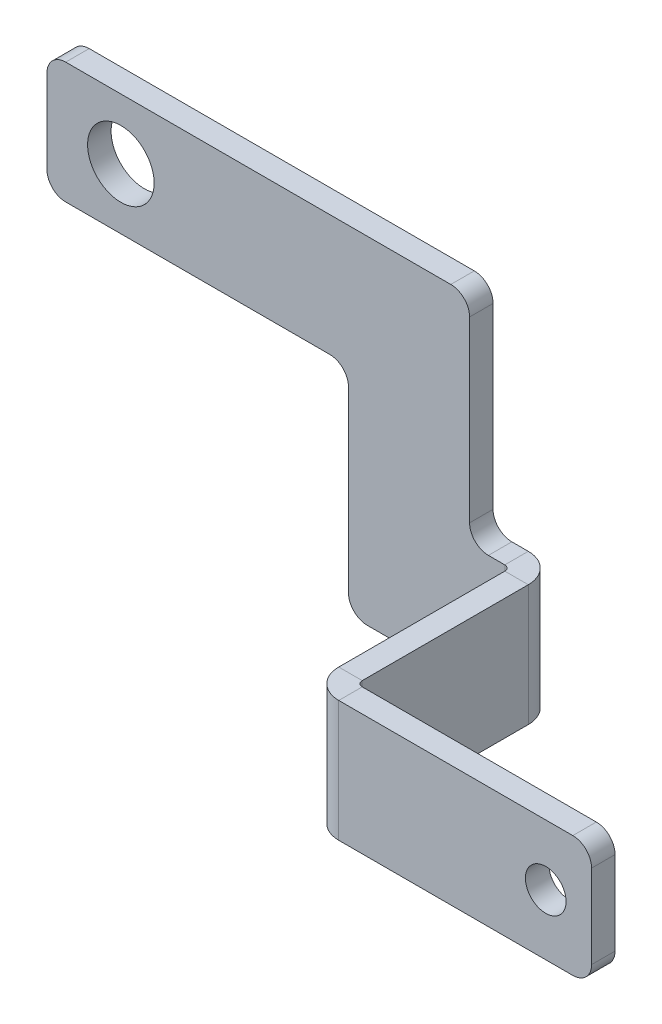
ISO-10303-21;
HEADER;
FILE_DESCRIPTION(('STEP AP214'),'2;1');
FILE_NAME('part.step','',(''),(''),'','','');
FILE_SCHEMA(('AUTOMOTIVE_DESIGN { 1 0 10303 214 1 1 1 1 }'));
ENDSEC;
DATA;
#1=APPLICATION_CONTEXT('core data for automotive mechanical design processes');
#2=APPLICATION_PROTOCOL_DEFINITION('international standard','automotive_design',2000,#1);
#3=PRODUCT_CONTEXT('',#1,'mechanical');
#4=PRODUCT('Part','Part','',(#3));
#5=PRODUCT_RELATED_PRODUCT_CATEGORY('part','',(#4));
#6=PRODUCT_DEFINITION_FORMATION('','',#4);
#7=PRODUCT_DEFINITION_CONTEXT('part definition',#1,'design');
#8=PRODUCT_DEFINITION('design','',#6,#7);
#9=PRODUCT_DEFINITION_SHAPE('','',#8);
#10=(LENGTH_UNIT() NAMED_UNIT(*) SI_UNIT(.MILLI.,.METRE.));
#11=(NAMED_UNIT(*) PLANE_ANGLE_UNIT() SI_UNIT($,.RADIAN.));
#12=(NAMED_UNIT(*) SI_UNIT($,.STERADIAN.) SOLID_ANGLE_UNIT());
#13=UNCERTAINTY_MEASURE_WITH_UNIT(LENGTH_MEASURE(1.E-05),#10,'distance_accuracy_value','');
#14=(GEOMETRIC_REPRESENTATION_CONTEXT(3) GLOBAL_UNCERTAINTY_ASSIGNED_CONTEXT((#13)) GLOBAL_UNIT_ASSIGNED_CONTEXT((#10,
#11,#12)) REPRESENTATION_CONTEXT('',''));
#15=CARTESIAN_POINT('',(0.,0.,0.));
#16=DIRECTION('',(0.,0.,1.));
#17=DIRECTION('',(1.,0.,0.));
#18=AXIS2_PLACEMENT_3D('',#15,#16,#17);
#19=CARTESIAN_POINT('',(65.8241,-45.5626000012021,0.));
#20=DIRECTION('',(0.,1.,0.));
#21=DIRECTION('',(0.,0.,1.));
#22=AXIS2_PLACEMENT_3D('',#19,#20,#21);
#23=PLANE('',#22);
#24=DIRECTION('',(-1.,0.,0.));
#25=VECTOR('',#24,1.);
#26=CARTESIAN_POINT('',(65.8241000000001,-45.5626000012021,23.1902));
#27=LINE('',#26,#25);
#28=CARTESIAN_POINT('',(65.8241000000001,-45.5626000012021,23.1902));
#29=VERTEX_POINT('',#28);
#30=CARTESIAN_POINT('',(62.6491000000001,-45.5626000012021,23.1902));
#31=VERTEX_POINT('',#30);
#32=EDGE_CURVE('E271',#29,#31,#27,.T.);
#33=ORIENTED_EDGE('',*,*,#32,.T.);
#34=DIRECTION('',(0.,0.,1.));
#35=VECTOR('',#34,1.);
#36=CARTESIAN_POINT('',(62.6491,-45.5626000012021,0.));
#37=LINE('',#36,#35);
#38=CARTESIAN_POINT('',(62.6491,-45.562600001202,0.736599999999997));
#39=VERTEX_POINT('',#38);
#40=EDGE_CURVE('E292',#31,#39,#37,.F.);
#41=ORIENTED_EDGE('',*,*,#40,.T.);
#42=DIRECTION('',(-1.,0.,0.));
#43=VECTOR('',#42,1.);
#44=CARTESIAN_POINT('',(65.8241,-45.5626000012021,0.736599999999986));
#45=LINE('',#44,#43);
#46=CARTESIAN_POINT('',(65.8241,-45.562600001202,0.736599999999986));
#47=VERTEX_POINT('',#46);
#48=EDGE_CURVE('E281',#39,#47,#45,.F.);
#49=ORIENTED_EDGE('',*,*,#48,.T.);
#50=DIRECTION('',(0.,0.,-1.));
#51=VECTOR('',#50,1.);
#52=CARTESIAN_POINT('',(65.8241,-45.5626000012021,-2.26544738483615E-13));
#53=LINE('',#52,#51);
#54=EDGE_CURVE('E287',#29,#47,#53,.T.);
#55=ORIENTED_EDGE('',*,*,#54,.F.);
#56=EDGE_LOOP('',(#33,#41,#49,#55));
#57=FACE_BOUND('',#56,.T.);
#58=ADVANCED_FACE('F60',(#57),#23,.F.);
#59=CARTESIAN_POINT('',(65.8241000000001,-29.1846000012021,23.9268));
#60=DIRECTION('',(0.,-1.,0.));
#61=DIRECTION('',(0.,0.,-1.));
#62=AXIS2_PLACEMENT_3D('',#59,#60,#61);
#63=PLANE('',#62);
#64=DIRECTION('',(-1.,0.,0.));
#65=VECTOR('',#64,1.);
#66=CARTESIAN_POINT('',(65.8241000000001,-29.1846000012021,23.1902));
#67=LINE('',#66,#65);
#68=CARTESIAN_POINT('',(65.8241000000001,-29.1846000012021,23.1902));
#69=VERTEX_POINT('',#68);
#70=CARTESIAN_POINT('',(62.6491000000001,-29.1846000012021,23.1902));
#71=VERTEX_POINT('',#70);
#72=EDGE_CURVE('E278',#69,#71,#67,.T.);
#73=ORIENTED_EDGE('',*,*,#72,.F.);
#74=DIRECTION('',(0.,0.,1.));
#75=VECTOR('',#74,1.);
#76=CARTESIAN_POINT('',(65.8241,-29.1846000012021,-2.30776579829644E-13));
#77=LINE('',#76,#75);
#78=CARTESIAN_POINT('',(65.8241,-29.1846000012021,0.736599999999986));
#79=VERTEX_POINT('',#78);
#80=EDGE_CURVE('E283',#79,#69,#77,.T.);
#81=ORIENTED_EDGE('',*,*,#80,.F.);
#82=DIRECTION('',(-1.,0.,0.));
#83=VECTOR('',#82,1.);
#84=CARTESIAN_POINT('',(62.6491,-29.1846000012021,0.736599999999997));
#85=LINE('',#84,#83);
#86=CARTESIAN_POINT('',(62.6491,-29.1846000012021,0.736599999999997));
#87=VERTEX_POINT('',#86);
#88=EDGE_CURVE('E297',#87,#79,#85,.F.);
#89=ORIENTED_EDGE('',*,*,#88,.F.);
#90=DIRECTION('',(0.,0.,-1.));
#91=VECTOR('',#90,1.);
#92=CARTESIAN_POINT('',(62.6491000000001,-29.1846000012021,23.9268));
#93=LINE('',#92,#91);
#94=EDGE_CURVE('E289',#87,#71,#93,.F.);
#95=ORIENTED_EDGE('',*,*,#94,.T.);
#96=EDGE_LOOP('',(#73,#81,#89,#95));
#97=FACE_BOUND('',#96,.T.);
#98=ADVANCED_FACE('F477',(#97),#63,.F.);
#99=CARTESIAN_POINT('',(65.8241,0.,-2.26544738483615E-13));
#100=DIRECTION('',(-1.,0.,0.));
#101=DIRECTION('',(0.,0.,1.));
#102=AXIS2_PLACEMENT_3D('',#99,#100,#101);
#103=PLANE('',#102);
#104=DIRECTION('',(0.,-1.,0.));
#105=VECTOR('',#104,1.);
#106=CARTESIAN_POINT('',(65.8241000000001,-45.5626000012021,23.1902));
#107=LINE('',#106,#105);
#108=EDGE_CURVE('E275',#29,#69,#107,.F.);
#109=ORIENTED_EDGE('',*,*,#108,.F.);
#110=ORIENTED_EDGE('',*,*,#54,.T.);
#111=DIRECTION('',(0.,1.,0.));
#112=VECTOR('',#111,1.);
#113=CARTESIAN_POINT('',(65.8241,-45.5626000012021,0.736599999999986));
#114=LINE('',#113,#112);
#115=EDGE_CURVE('E294',#79,#47,#114,.F.);
#116=ORIENTED_EDGE('',*,*,#115,.F.);
#117=ORIENTED_EDGE('',*,*,#80,.T.);
#118=EDGE_LOOP('',(#109,#110,#116,#117));
#119=FACE_BOUND('',#118,.T.);
#120=ADVANCED_FACE('F472',(#119),#103,.F.);
#121=CARTESIAN_POINT('',(62.6491,0.,-2.15459285232788E-13));
#122=DIRECTION('',(-1.,0.,0.));
#123=DIRECTION('',(0.,0.,1.));
#124=AXIS2_PLACEMENT_3D('',#121,#122,#123);
#125=PLANE('',#124);
#126=ORIENTED_EDGE('',*,*,#40,.F.);
#127=DIRECTION('',(0.,-1.,0.));
#128=VECTOR('',#127,1.);
#129=CARTESIAN_POINT('',(62.6491000000001,-45.5626000012021,23.1902));
#130=LINE('',#129,#128);
#131=EDGE_CURVE('E228',#31,#71,#130,.F.);
#132=ORIENTED_EDGE('',*,*,#131,.T.);
#133=ORIENTED_EDGE('',*,*,#94,.F.);
#134=DIRECTION('',(0.,1.,0.));
#135=VECTOR('',#134,1.);
#136=CARTESIAN_POINT('',(62.6491,-45.5626000012021,0.736599999999997));
#137=LINE('',#136,#135);
#138=EDGE_CURVE('E300',#39,#87,#137,.T.);
#139=ORIENTED_EDGE('',*,*,#138,.F.);
#140=EDGE_LOOP('',(#126,#132,#133,#139));
#141=FACE_BOUND('',#140,.T.);
#142=ADVANCED_FACE('F486',(#141),#125,.T.);
#143=CARTESIAN_POINT('',(0.,0.,-3.175));
#144=DIRECTION('',(-1.,0.,0.));
#145=DIRECTION('',(0.,-1.,0.));
#146=AXIS2_PLACEMENT_3D('',#143,#144,#145);
#147=PLANE('',#146);
#148=DIRECTION('',(0.,-1.,0.));
#149=VECTOR('',#148,1.);
#150=CARTESIAN_POINT('',(0.,0.,-3.175));
#151=LINE('',#150,#149);
#152=CARTESIAN_POINT('',(0.,-2.54,-3.175));
#153=VERTEX_POINT('',#152);
#154=CARTESIAN_POINT('',(0.,-13.838,-3.175));
#155=VERTEX_POINT('',#154);
#156=EDGE_CURVE('E322',#153,#155,#151,.T.);
#157=ORIENTED_EDGE('',*,*,#156,.T.);
#158=DIRECTION('',(0.,0.,1.));
#159=VECTOR('',#158,1.);
#160=CARTESIAN_POINT('',(0.,-13.838,-3.175));
#161=LINE('',#160,#159);
#162=CARTESIAN_POINT('',(0.,-13.838,0.));
#163=VERTEX_POINT('',#162);
#164=EDGE_CURVE('E406',#155,#163,#161,.T.);
#165=ORIENTED_EDGE('',*,*,#164,.T.);
#166=DIRECTION('',(0.,-1.,0.));
#167=VECTOR('',#166,1.);
#168=CARTESIAN_POINT('',(0.,0.,0.));
#169=LINE('',#168,#167);
#170=CARTESIAN_POINT('',(0.,-2.54,0.));
#171=VERTEX_POINT('',#170);
#172=EDGE_CURVE('E321',#171,#163,#169,.T.);
#173=ORIENTED_EDGE('',*,*,#172,.F.);
#174=DIRECTION('',(0.,0.,1.));
#175=VECTOR('',#174,1.);
#176=CARTESIAN_POINT('',(0.,-2.54,-3.175));
#177=LINE('',#176,#175);
#178=EDGE_CURVE('E404',#171,#153,#177,.F.);
#179=ORIENTED_EDGE('',*,*,#178,.T.);
#180=EDGE_LOOP('',(#157,#165,#173,#179));
#181=FACE_BOUND('',#180,.T.);
#182=ADVANCED_FACE('F527',(#181),#147,.T.);
#183=CARTESIAN_POINT('',(0.,0.,-3.175));
#184=DIRECTION('',(0.,1.,0.));
#185=DIRECTION('',(0.,0.,1.));
#186=AXIS2_PLACEMENT_3D('',#183,#184,#185);
#187=PLANE('',#186);
#188=DIRECTION('',(-1.,0.,0.));
#189=VECTOR('',#188,1.);
#190=CARTESIAN_POINT('',(0.,0.,-3.175));
#191=LINE('',#190,#189);
#192=CARTESIAN_POINT('',(54.61,0.,-3.175));
#193=VERTEX_POINT('',#192);
#194=CARTESIAN_POINT('',(2.54,0.,-3.175));
#195=VERTEX_POINT('',#194);
#196=EDGE_CURVE('E342',#193,#195,#191,.T.);
#197=ORIENTED_EDGE('',*,*,#196,.T.);
#198=DIRECTION('',(0.,0.,1.));
#199=VECTOR('',#198,1.);
#200=CARTESIAN_POINT('',(2.54,0.,-3.175));
#201=LINE('',#200,#199);
#202=CARTESIAN_POINT('',(2.54,0.,0.));
#203=VERTEX_POINT('',#202);
#204=EDGE_CURVE('E427',#195,#203,#201,.T.);
#205=ORIENTED_EDGE('',*,*,#204,.T.);
#206=DIRECTION('',(-1.,0.,0.));
#207=VECTOR('',#206,1.);
#208=CARTESIAN_POINT('',(0.,0.,0.));
#209=LINE('',#208,#207);
#210=CARTESIAN_POINT('',(54.61,0.,0.));
#211=VERTEX_POINT('',#210);
#212=EDGE_CURVE('E326',#211,#203,#209,.T.);
#213=ORIENTED_EDGE('',*,*,#212,.F.);
#214=DIRECTION('',(0.,0.,1.));
#215=VECTOR('',#214,1.);
#216=CARTESIAN_POINT('',(54.61,0.,-3.175));
#217=LINE('',#216,#215);
#218=EDGE_CURVE('E425',#211,#193,#217,.F.);
#219=ORIENTED_EDGE('',*,*,#218,.T.);
#220=EDGE_LOOP('',(#197,#205,#213,#219));
#221=FACE_BOUND('',#220,.T.);
#222=ADVANCED_FACE('F531',(#221),#187,.T.);
#223=CARTESIAN_POINT('',(57.15,0.,-3.175));
#224=DIRECTION('',(1.,0.,0.));
#225=DIRECTION('',(0.,0.,-1.));
#226=AXIS2_PLACEMENT_3D('',#223,#224,#225);
#227=PLANE('',#226);
#228=DIRECTION('',(0.,1.,0.));
#229=VECTOR('',#228,1.);
#230=CARTESIAN_POINT('',(57.15,-16.378,-3.175));
#231=LINE('',#230,#229);
#232=CARTESIAN_POINT('',(57.15,-26.6446000012021,-3.175));
#233=VERTEX_POINT('',#232);
#234=CARTESIAN_POINT('',(57.15,-2.54,-3.175));
#235=VERTEX_POINT('',#234);
#236=EDGE_CURVE('E339',#233,#235,#231,.T.);
#237=ORIENTED_EDGE('',*,*,#236,.T.);
#238=DIRECTION('',(0.,0.,1.));
#239=VECTOR('',#238,1.);
#240=CARTESIAN_POINT('',(57.15,-2.54,-3.175));
#241=LINE('',#240,#239);
#242=CARTESIAN_POINT('',(57.15,-2.54,0.));
#243=VERTEX_POINT('',#242);
#244=EDGE_CURVE('E432',#235,#243,#241,.T.);
#245=ORIENTED_EDGE('',*,*,#244,.T.);
#246=DIRECTION('',(0.,1.,0.));
#247=VECTOR('',#246,1.);
#248=CARTESIAN_POINT('',(57.15,0.,0.));
#249=LINE('',#248,#247);
#250=CARTESIAN_POINT('',(57.15,-26.6446000012021,0.));
#251=VERTEX_POINT('',#250);
#252=EDGE_CURVE('E362',#251,#243,#249,.T.);
#253=ORIENTED_EDGE('',*,*,#252,.F.);
#254=DIRECTION('',(0.,0.,1.));
#255=VECTOR('',#254,1.);
#256=CARTESIAN_POINT('',(57.15,-26.6446000012021,-3.175));
#257=LINE('',#256,#255);
#258=EDGE_CURVE('E430',#251,#233,#257,.F.);
#259=ORIENTED_EDGE('',*,*,#258,.T.);
#260=EDGE_LOOP('',(#237,#245,#253,#259));
#261=FACE_BOUND('',#260,.T.);
#262=ADVANCED_FACE('F449',(#261),#227,.T.);
#263=CARTESIAN_POINT('',(57.15,-29.1846000012021,-3.175));
#264=DIRECTION('',(0.,1.,0.));
#265=DIRECTION('',(0.,0.,1.));
#266=AXIS2_PLACEMENT_3D('',#263,#264,#265);
#267=PLANE('',#266);
#268=DIRECTION('',(-1.,0.,0.));
#269=VECTOR('',#268,1.);
#270=CARTESIAN_POINT('',(57.15,-29.1846000012021,-3.175));
#271=LINE('',#270,#269);
#272=CARTESIAN_POINT('',(61.9125,-29.1846000012021,-3.175));
#273=VERTEX_POINT('',#272);
#274=CARTESIAN_POINT('',(59.69,-29.1846000012021,-3.175));
#275=VERTEX_POINT('',#274);
#276=EDGE_CURVE('E337',#273,#275,#271,.T.);
#277=ORIENTED_EDGE('',*,*,#276,.T.);
#278=DIRECTION('',(0.,0.,1.));
#279=VECTOR('',#278,1.);
#280=CARTESIAN_POINT('',(59.69,-29.1846000012021,0.));
#281=LINE('',#280,#279);
#282=CARTESIAN_POINT('',(59.69,-29.1846000012021,0.));
#283=VERTEX_POINT('',#282);
#284=EDGE_CURVE('E435',#275,#283,#281,.T.);
#285=ORIENTED_EDGE('',*,*,#284,.T.);
#286=DIRECTION('',(-1.,0.,0.));
#287=VECTOR('',#286,1.);
#288=CARTESIAN_POINT('',(57.15,-29.1846000012021,0.));
#289=LINE('',#288,#287);
#290=CARTESIAN_POINT('',(61.9125,-29.1846000012021,0.));
#291=VERTEX_POINT('',#290);
#292=EDGE_CURVE('E359',#291,#283,#289,.T.);
#293=ORIENTED_EDGE('',*,*,#292,.F.);
#294=DIRECTION('',(0.,0.,1.));
#295=VECTOR('',#294,1.);
#296=CARTESIAN_POINT('',(61.9125,-29.1846000012021,-3.175));
#297=LINE('',#296,#295);
#298=EDGE_CURVE('E367',#273,#291,#297,.T.);
#299=ORIENTED_EDGE('',*,*,#298,.F.);
#300=EDGE_LOOP('',(#277,#285,#293,#299));
#301=FACE_BOUND('',#300,.T.);
#302=ADVANCED_FACE('F453',(#301),#267,.T.);
#303=CARTESIAN_POINT('',(57.15,-45.5626000012021,-3.175));
#304=DIRECTION('',(0.,-1.,0.));
#305=DIRECTION('',(1.,0.,0.));
#306=AXIS2_PLACEMENT_3D('',#303,#304,#305);
#307=PLANE('',#306);
#308=DIRECTION('',(1.,0.,0.));
#309=VECTOR('',#308,1.);
#310=CARTESIAN_POINT('',(57.15,-45.5626000012021,0.));
#311=LINE('',#310,#309);
#312=CARTESIAN_POINT('',(43.312,-45.5626000012021,0.));
#313=VERTEX_POINT('',#312);
#314=CARTESIAN_POINT('',(61.9125,-45.5626000012021,0.));
#315=VERTEX_POINT('',#314);
#316=EDGE_CURVE('E354',#313,#315,#311,.T.);
#317=ORIENTED_EDGE('',*,*,#316,.F.);
#318=DIRECTION('',(0.,0.,1.));
#319=VECTOR('',#318,1.);
#320=CARTESIAN_POINT('',(43.312,-45.5626000012021,-3.175));
#321=LINE('',#320,#319);
#322=CARTESIAN_POINT('',(43.312,-45.5626000012021,-3.175));
#323=VERTEX_POINT('',#322);
#324=EDGE_CURVE('E75',#313,#323,#321,.F.);
#325=ORIENTED_EDGE('',*,*,#324,.T.);
#326=DIRECTION('',(1.,0.,0.));
#327=VECTOR('',#326,1.);
#328=CARTESIAN_POINT('',(57.15,-45.5626000012021,-3.175));
#329=LINE('',#328,#327);
#330=CARTESIAN_POINT('',(61.9125,-45.5626000012021,-3.175));
#331=VERTEX_POINT('',#330);
#332=EDGE_CURVE('E332',#323,#331,#329,.T.);
#333=ORIENTED_EDGE('',*,*,#332,.T.);
#334=DIRECTION('',(0.,0.,1.));
#335=VECTOR('',#334,1.);
#336=CARTESIAN_POINT('',(61.9125,-45.5626000012021,-3.175));
#337=LINE('',#336,#335);
#338=EDGE_CURVE('E345',#331,#315,#337,.T.);
#339=ORIENTED_EDGE('',*,*,#338,.T.);
#340=EDGE_LOOP('',(#317,#325,#333,#339));
#341=FACE_BOUND('',#340,.T.);
#342=ADVANCED_FACE('F596',(#341),#307,.T.);
#343=CARTESIAN_POINT('',(40.772,-16.378,-3.175));
#344=DIRECTION('',(-1.,0.,0.));
#345=DIRECTION('',(0.,0.,1.));
#346=AXIS2_PLACEMENT_3D('',#343,#344,#345);
#347=PLANE('',#346);
#348=DIRECTION('',(0.,-1.,0.));
#349=VECTOR('',#348,1.);
#350=CARTESIAN_POINT('',(40.772,-16.378,0.));
#351=LINE('',#350,#349);
#352=CARTESIAN_POINT('',(40.772,-18.918,0.));
#353=VERTEX_POINT('',#352);
#354=CARTESIAN_POINT('',(40.772,-43.0226000012021,0.));
#355=VERTEX_POINT('',#354);
#356=EDGE_CURVE('E351',#353,#355,#351,.T.);
#357=ORIENTED_EDGE('',*,*,#356,.F.);
#358=DIRECTION('',(0.,0.,1.));
#359=VECTOR('',#358,1.);
#360=CARTESIAN_POINT('',(40.772,-18.918,-3.175));
#361=LINE('',#360,#359);
#362=CARTESIAN_POINT('',(40.772,-18.918,-3.175));
#363=VERTEX_POINT('',#362);
#364=EDGE_CURVE('E385',#353,#363,#361,.F.);
#365=ORIENTED_EDGE('',*,*,#364,.T.);
#366=DIRECTION('',(0.,-1.,0.));
#367=VECTOR('',#366,1.);
#368=CARTESIAN_POINT('',(40.772,-16.378,-3.175));
#369=LINE('',#368,#367);
#370=CARTESIAN_POINT('',(40.772,-43.0226000012021,-3.175));
#371=VERTEX_POINT('',#370);
#372=EDGE_CURVE('E329',#363,#371,#369,.T.);
#373=ORIENTED_EDGE('',*,*,#372,.T.);
#374=DIRECTION('',(0.,0.,1.));
#375=VECTOR('',#374,1.);
#376=CARTESIAN_POINT('',(40.772,-43.0226000012021,-3.175));
#377=LINE('',#376,#375);
#378=EDGE_CURVE('E382',#371,#355,#377,.T.);
#379=ORIENTED_EDGE('',*,*,#378,.T.);
#380=EDGE_LOOP('',(#357,#365,#373,#379));
#381=FACE_BOUND('',#380,.T.);
#382=ADVANCED_FACE('F579',(#381),#347,.T.);
#383=CARTESIAN_POINT('',(0.,-16.378,-3.175));
#384=DIRECTION('',(0.,-1.,0.));
#385=DIRECTION('',(0.,0.,-1.));
#386=AXIS2_PLACEMENT_3D('',#383,#384,#385);
#387=PLANE('',#386);
#388=DIRECTION('',(1.,0.,0.));
#389=VECTOR('',#388,1.);
#390=CARTESIAN_POINT('',(0.,-16.378,-3.175));
#391=LINE('',#390,#389);
#392=CARTESIAN_POINT('',(2.54,-16.378,-3.175));
#393=VERTEX_POINT('',#392);
#394=CARTESIAN_POINT('',(38.232,-16.378,-3.175));
#395=VERTEX_POINT('',#394);
#396=EDGE_CURVE('E325',#393,#395,#391,.T.);
#397=ORIENTED_EDGE('',*,*,#396,.T.);
#398=DIRECTION('',(0.,0.,1.));
#399=VECTOR('',#398,1.);
#400=CARTESIAN_POINT('',(38.232,-16.378,0.));
#401=LINE('',#400,#399);
#402=CARTESIAN_POINT('',(38.232,-16.378,0.));
#403=VERTEX_POINT('',#402);
#404=EDGE_CURVE('E379',#395,#403,#401,.T.);
#405=ORIENTED_EDGE('',*,*,#404,.T.);
#406=DIRECTION('',(1.,0.,0.));
#407=VECTOR('',#406,1.);
#408=CARTESIAN_POINT('',(0.,-16.378,0.));
#409=LINE('',#408,#407);
#410=CARTESIAN_POINT('',(2.54,-16.378,0.));
#411=VERTEX_POINT('',#410);
#412=EDGE_CURVE('E348',#411,#403,#409,.T.);
#413=ORIENTED_EDGE('',*,*,#412,.F.);
#414=DIRECTION('',(0.,0.,1.));
#415=VECTOR('',#414,1.);
#416=CARTESIAN_POINT('',(2.54,-16.378,-3.175));
#417=LINE('',#416,#415);
#418=EDGE_CURVE('E370',#411,#393,#417,.F.);
#419=ORIENTED_EDGE('',*,*,#418,.T.);
#420=EDGE_LOOP('',(#397,#405,#413,#419));
#421=FACE_BOUND('',#420,.T.);
#422=ADVANCED_FACE('F541',(#421),#387,.T.);
#423=CARTESIAN_POINT('',(0.,0.,-3.175));
#424=DIRECTION('',(0.,0.,1.));
#425=DIRECTION('',(1.,0.,0.));
#426=AXIS2_PLACEMENT_3D('',#423,#424,#425);
#427=PLANE('',#426);
#428=CARTESIAN_POINT('',(10.,-8.189,-3.175));
#429=DIRECTION('',(0.,0.,1.));
#430=DIRECTION('',(1.,0.,0.));
#431=AXIS2_PLACEMENT_3D('',#428,#429,#430);
#432=CIRCLE('',#431,4.5);
#433=CARTESIAN_POINT('',(14.5,-8.189,-3.175));
#434=VERTEX_POINT('',#433);
#435=EDGE_CURVE('E318',#434,#434,#432,.T.);
#436=ORIENTED_EDGE('',*,*,#435,.T.);
#437=EDGE_LOOP('',(#436));
#438=FACE_BOUND('',#437,.T.);
#439=ORIENTED_EDGE('',*,*,#396,.F.);
#440=CARTESIAN_POINT('',(2.54,-13.838,-3.175));
#441=DIRECTION('',(0.,0.,1.));
#442=DIRECTION('',(1.,0.,0.));
#443=AXIS2_PLACEMENT_3D('',#440,#441,#442);
#444=CIRCLE('',#443,2.54);
#445=EDGE_CURVE('E423',#393,#155,#444,.F.);
#446=ORIENTED_EDGE('',*,*,#445,.T.);
#447=ORIENTED_EDGE('',*,*,#156,.F.);
#448=CARTESIAN_POINT('',(2.54,-2.54,-3.175));
#449=DIRECTION('',(0.,0.,1.));
#450=DIRECTION('',(1.,0.,0.));
#451=AXIS2_PLACEMENT_3D('',#448,#449,#450);
#452=CIRCLE('',#451,2.54);
#453=EDGE_CURVE('E421',#153,#195,#452,.F.);
#454=ORIENTED_EDGE('',*,*,#453,.T.);
#455=ORIENTED_EDGE('',*,*,#196,.F.);
#456=CARTESIAN_POINT('',(54.61,-2.54,-3.175));
#457=DIRECTION('',(0.,0.,1.));
#458=DIRECTION('',(1.,0.,0.));
#459=AXIS2_PLACEMENT_3D('',#456,#457,#458);
#460=CIRCLE('',#459,2.54);
#461=EDGE_CURVE('E419',#193,#235,#460,.F.);
#462=ORIENTED_EDGE('',*,*,#461,.T.);
#463=ORIENTED_EDGE('',*,*,#236,.F.);
#464=CARTESIAN_POINT('',(59.69,-26.6446000012021,-3.175));
#465=DIRECTION('',(0.,0.,1.));
#466=DIRECTION('',(1.,0.,0.));
#467=AXIS2_PLACEMENT_3D('',#464,#465,#466);
#468=CIRCLE('',#467,2.54);
#469=EDGE_CURVE('E13',#233,#275,#468,.T.);
#470=ORIENTED_EDGE('',*,*,#469,.T.);
#471=ORIENTED_EDGE('',*,*,#276,.F.);
#472=DIRECTION('',(0.,1.,0.));
#473=VECTOR('',#472,1.);
#474=CARTESIAN_POINT('',(61.9125,-45.5626000012021,-3.175));
#475=LINE('',#474,#473);
#476=EDGE_CURVE('E334',#331,#273,#475,.T.);
#477=ORIENTED_EDGE('',*,*,#476,.F.);
#478=ORIENTED_EDGE('',*,*,#332,.F.);
#479=CARTESIAN_POINT('',(43.312,-43.0226000012021,-3.175));
#480=DIRECTION('',(0.,0.,1.));
#481=DIRECTION('',(1.,0.,0.));
#482=AXIS2_PLACEMENT_3D('',#479,#480,#481);
#483=CIRCLE('',#482,2.54);
#484=EDGE_CURVE('E417',#323,#371,#483,.F.);
#485=ORIENTED_EDGE('',*,*,#484,.T.);
#486=ORIENTED_EDGE('',*,*,#372,.F.);
#487=CARTESIAN_POINT('',(38.232,-18.918,-3.175));
#488=DIRECTION('',(0.,0.,1.));
#489=DIRECTION('',(1.,0.,0.));
#490=AXIS2_PLACEMENT_3D('',#487,#488,#489);
#491=CIRCLE('',#490,2.54);
#492=EDGE_CURVE('E441',#363,#395,#491,.T.);
#493=ORIENTED_EDGE('',*,*,#492,.T.);
#494=EDGE_LOOP('',(#439,#446,#447,#454,#455,#462,#463,#470,#471,#477,#478,#485,#486,#493));
#495=FACE_BOUND('',#494,.T.);
#496=ADVANCED_FACE('F457',(#438,#495),#427,.F.);
#497=CARTESIAN_POINT('',(0.,0.,0.));
#498=DIRECTION('',(0.,0.,1.));
#499=DIRECTION('',(1.,0.,0.));
#500=AXIS2_PLACEMENT_3D('',#497,#498,#499);
#501=PLANE('',#500);
#502=CARTESIAN_POINT('',(10.,-8.189,0.));
#503=DIRECTION('',(0.,0.,1.));
#504=DIRECTION('',(1.,0.,0.));
#505=AXIS2_PLACEMENT_3D('',#502,#503,#504);
#506=CIRCLE('',#505,4.5);
#507=CARTESIAN_POINT('',(14.5,-8.189,0.));
#508=VERTEX_POINT('',#507);
#509=EDGE_CURVE('E307',#508,#508,#506,.T.);
#510=ORIENTED_EDGE('',*,*,#509,.F.);
#511=EDGE_LOOP('',(#510));
#512=FACE_BOUND('',#511,.T.);
#513=ORIENTED_EDGE('',*,*,#172,.T.);
#514=CARTESIAN_POINT('',(2.54,-13.838,0.));
#515=DIRECTION('',(0.,0.,1.));
#516=DIRECTION('',(1.,0.,0.));
#517=AXIS2_PLACEMENT_3D('',#514,#515,#516);
#518=CIRCLE('',#517,2.54);
#519=EDGE_CURVE('E415',#163,#411,#518,.T.);
#520=ORIENTED_EDGE('',*,*,#519,.T.);
#521=ORIENTED_EDGE('',*,*,#412,.T.);
#522=CARTESIAN_POINT('',(38.232,-18.918,0.));
#523=DIRECTION('',(0.,0.,1.));
#524=DIRECTION('',(1.,0.,0.));
#525=AXIS2_PLACEMENT_3D('',#522,#523,#524);
#526=CIRCLE('',#525,2.54);
#527=EDGE_CURVE('E439',#403,#353,#526,.F.);
#528=ORIENTED_EDGE('',*,*,#527,.T.);
#529=ORIENTED_EDGE('',*,*,#356,.T.);
#530=CARTESIAN_POINT('',(43.312,-43.0226000012021,0.));
#531=DIRECTION('',(0.,0.,1.));
#532=DIRECTION('',(1.,0.,0.));
#533=AXIS2_PLACEMENT_3D('',#530,#531,#532);
#534=CIRCLE('',#533,2.54);
#535=EDGE_CURVE('E409',#355,#313,#534,.T.);
#536=ORIENTED_EDGE('',*,*,#535,.T.);
#537=ORIENTED_EDGE('',*,*,#316,.T.);
#538=DIRECTION('',(0.,1.,0.));
#539=VECTOR('',#538,1.);
#540=CARTESIAN_POINT('',(61.9125,-45.5626000012021,0.));
#541=LINE('',#540,#539);
#542=EDGE_CURVE('E356',#315,#291,#541,.T.);
#543=ORIENTED_EDGE('',*,*,#542,.T.);
#544=ORIENTED_EDGE('',*,*,#292,.T.);
#545=CARTESIAN_POINT('',(59.69,-26.6446000012021,0.));
#546=DIRECTION('',(0.,0.,1.));
#547=DIRECTION('',(1.,0.,0.));
#548=AXIS2_PLACEMENT_3D('',#545,#546,#547);
#549=CIRCLE('',#548,2.54);
#550=EDGE_CURVE('E68',#283,#251,#549,.F.);
#551=ORIENTED_EDGE('',*,*,#550,.T.);
#552=ORIENTED_EDGE('',*,*,#252,.T.);
#553=CARTESIAN_POINT('',(54.61,-2.54,0.));
#554=DIRECTION('',(0.,0.,1.));
#555=DIRECTION('',(1.,0.,0.));
#556=AXIS2_PLACEMENT_3D('',#553,#554,#555);
#557=CIRCLE('',#556,2.54);
#558=EDGE_CURVE('E411',#243,#211,#557,.T.);
#559=ORIENTED_EDGE('',*,*,#558,.T.);
#560=ORIENTED_EDGE('',*,*,#212,.T.);
#561=CARTESIAN_POINT('',(2.54,-2.54,0.));
#562=DIRECTION('',(0.,0.,1.));
#563=DIRECTION('',(1.,0.,0.));
#564=AXIS2_PLACEMENT_3D('',#561,#562,#563);
#565=CIRCLE('',#564,2.54);
#566=EDGE_CURVE('E413',#203,#171,#565,.T.);
#567=ORIENTED_EDGE('',*,*,#566,.T.);
#568=EDGE_LOOP('',(#513,#520,#521,#528,#529,#536,#537,#543,#544,#551,#552,#559,#560,#567));
#569=FACE_BOUND('',#568,.T.);
#570=ADVANCED_FACE('F444',(#512,#569),#501,.T.);
#571=CARTESIAN_POINT('',(10.,-8.189,0.));
#572=DIRECTION('',(0.,0.,1.));
#573=DIRECTION('',(1.,0.,0.));
#574=AXIS2_PLACEMENT_3D('',#571,#572,#573);
#575=CYLINDRICAL_SURFACE('',#574,4.5);
#576=ORIENTED_EDGE('',*,*,#435,.F.);
#577=EDGE_LOOP('',(#576));
#578=FACE_BOUND('',#577,.T.);
#579=ORIENTED_EDGE('',*,*,#509,.T.);
#580=EDGE_LOOP('',(#579));
#581=FACE_BOUND('',#580,.T.);
#582=ADVANCED_FACE('F501',(#578,#581),#575,.F.);
#583=CARTESIAN_POINT('',(61.9125,-45.5626000012021,0.7366));
#584=DIRECTION('',(0.,-1.,0.));
#585=DIRECTION('',(0.,0.,-1.));
#586=AXIS2_PLACEMENT_3D('',#583,#584,#585);
#587=PLANE('',#586);
#588=ORIENTED_EDGE('',*,*,#48,.F.);
#589=CARTESIAN_POINT('',(61.9125,-45.5626000012021,0.7366));
#590=DIRECTION('',(0.,1.,0.));
#591=DIRECTION('',(0.,0.,1.));
#592=AXIS2_PLACEMENT_3D('',#589,#590,#591);
#593=CIRCLE('',#592,0.736599999999997);
#594=EDGE_CURVE('E311',#315,#39,#593,.F.);
#595=ORIENTED_EDGE('',*,*,#594,.F.);
#596=ORIENTED_EDGE('',*,*,#338,.F.);
#597=CARTESIAN_POINT('',(61.9125,-45.562600001202,0.7366));
#598=DIRECTION('',(0.,1.,0.));
#599=DIRECTION('',(0.,0.,1.));
#600=AXIS2_PLACEMENT_3D('',#597,#598,#599);
#601=CIRCLE('',#600,3.9116);
#602=EDGE_CURVE('E304',#331,#47,#601,.F.);
#603=ORIENTED_EDGE('',*,*,#602,.T.);
#604=EDGE_LOOP('',(#588,#595,#596,#603));
#605=FACE_BOUND('',#604,.T.);
#606=ADVANCED_FACE('F465',(#605),#587,.T.);
#607=CARTESIAN_POINT('',(61.9125,-29.1846000012021,0.7366));
#608=DIRECTION('',(0.,-1.,0.));
#609=DIRECTION('',(0.,0.,-1.));
#610=AXIS2_PLACEMENT_3D('',#607,#608,#609);
#611=PLANE('',#610);
#612=CARTESIAN_POINT('',(61.9125,-29.1846000012021,0.7366));
#613=DIRECTION('',(0.,1.,0.));
#614=DIRECTION('',(0.,0.,1.));
#615=AXIS2_PLACEMENT_3D('',#612,#613,#614);
#616=CIRCLE('',#615,0.736599999999997);
#617=EDGE_CURVE('E286',#87,#291,#616,.T.);
#618=ORIENTED_EDGE('',*,*,#617,.F.);
#619=ORIENTED_EDGE('',*,*,#88,.T.);
#620=CARTESIAN_POINT('',(61.9125,-29.1846000012021,0.7366));
#621=DIRECTION('',(0.,1.,0.));
#622=DIRECTION('',(0.,0.,1.));
#623=AXIS2_PLACEMENT_3D('',#620,#621,#622);
#624=CIRCLE('',#623,3.9116);
#625=EDGE_CURVE('E308',#79,#273,#624,.T.);
#626=ORIENTED_EDGE('',*,*,#625,.T.);
#627=ORIENTED_EDGE('',*,*,#298,.T.);
#628=EDGE_LOOP('',(#618,#619,#626,#627));
#629=FACE_BOUND('',#628,.T.);
#630=ADVANCED_FACE('F493',(#629),#611,.F.);
#631=CARTESIAN_POINT('',(61.9125,-29.1846000012021,0.7366));
#632=DIRECTION('',(0.,1.,0.));
#633=DIRECTION('',(1.,0.,0.));
#634=AXIS2_PLACEMENT_3D('',#631,#632,#633);
#635=CYLINDRICAL_SURFACE('',#634,3.9116);
#636=ORIENTED_EDGE('',*,*,#476,.T.);
#637=ORIENTED_EDGE('',*,*,#625,.F.);
#638=ORIENTED_EDGE('',*,*,#115,.T.);
#639=ORIENTED_EDGE('',*,*,#602,.F.);
#640=EDGE_LOOP('',(#636,#637,#638,#639));
#641=FACE_BOUND('',#640,.T.);
#642=ADVANCED_FACE('F467',(#641),#635,.T.);
#643=CARTESIAN_POINT('',(61.9125,-29.1846000012021,0.7366));
#644=DIRECTION('',(0.,1.,0.));
#645=DIRECTION('',(1.,0.,0.));
#646=AXIS2_PLACEMENT_3D('',#643,#644,#645);
#647=CYLINDRICAL_SURFACE('',#646,0.736599999999997);
#648=ORIENTED_EDGE('',*,*,#542,.F.);
#649=ORIENTED_EDGE('',*,*,#594,.T.);
#650=ORIENTED_EDGE('',*,*,#138,.T.);
#651=ORIENTED_EDGE('',*,*,#617,.T.);
#652=EDGE_LOOP('',(#648,#649,#650,#651));
#653=FACE_BOUND('',#652,.T.);
#654=ADVANCED_FACE('F490',(#653),#647,.F.);
#655=CARTESIAN_POINT('',(66.5607000000001,-29.1846000012021,23.1902));
#656=DIRECTION('',(0.,1.,0.));
#657=DIRECTION('',(0.,0.,1.));
#658=AXIS2_PLACEMENT_3D('',#655,#656,#657);
#659=PLANE('',#658);
#660=DIRECTION('',(0.,0.,1.));
#661=VECTOR('',#660,1.);
#662=CARTESIAN_POINT('',(66.5607000000001,-29.1846000012021,23.9268));
#663=LINE('',#662,#661);
#664=CARTESIAN_POINT('',(66.5607000000001,-29.1846000012021,23.9268));
#665=VERTEX_POINT('',#664);
#666=CARTESIAN_POINT('',(66.5607000000001,-29.1846000012021,27.1018));
#667=VERTEX_POINT('',#666);
#668=EDGE_CURVE('E376',#665,#667,#663,.T.);
#669=ORIENTED_EDGE('',*,*,#668,.F.);
#670=CARTESIAN_POINT('',(66.5607000000001,-29.1846000012021,23.1902));
#671=DIRECTION('',(0.,-1.,0.));
#672=DIRECTION('',(0.,0.,-1.));
#673=AXIS2_PLACEMENT_3D('',#670,#671,#672);
#674=CIRCLE('',#673,0.736600000000004);
#675=EDGE_CURVE('E231',#69,#665,#674,.F.);
#676=ORIENTED_EDGE('',*,*,#675,.F.);
#677=ORIENTED_EDGE('',*,*,#72,.T.);
#678=CARTESIAN_POINT('',(66.5607000000001,-29.1846000012021,23.1902));
#679=DIRECTION('',(0.,-1.,0.));
#680=DIRECTION('',(0.,0.,-1.));
#681=AXIS2_PLACEMENT_3D('',#678,#679,#680);
#682=CIRCLE('',#681,3.9116);
#683=EDGE_CURVE('E270',#71,#667,#682,.F.);
#684=ORIENTED_EDGE('',*,*,#683,.T.);
#685=EDGE_LOOP('',(#669,#676,#677,#684));
#686=FACE_BOUND('',#685,.T.);
#687=ADVANCED_FACE('F482',(#686),#659,.T.);
#688=CARTESIAN_POINT('',(66.5607000000001,-45.5626000012021,23.1902));
#689=DIRECTION('',(0.,1.,0.));
#690=DIRECTION('',(0.,0.,1.));
#691=AXIS2_PLACEMENT_3D('',#688,#689,#690);
#692=PLANE('',#691);
#693=CARTESIAN_POINT('',(66.5607000000001,-45.5626000012021,23.1902));
#694=DIRECTION('',(0.,-1.,0.));
#695=DIRECTION('',(0.,0.,-1.));
#696=AXIS2_PLACEMENT_3D('',#693,#694,#695);
#697=CIRCLE('',#696,0.736600000000004);
#698=CARTESIAN_POINT('',(66.5607000000001,-45.5626000012021,23.9268));
#699=VERTEX_POINT('',#698);
#700=EDGE_CURVE('E238',#699,#29,#697,.T.);
#701=ORIENTED_EDGE('',*,*,#700,.F.);
#702=DIRECTION('',(0.,0.,1.));
#703=VECTOR('',#702,1.);
#704=CARTESIAN_POINT('',(66.5607000000001,-45.5626000012021,23.9268));
#705=LINE('',#704,#703);
#706=CARTESIAN_POINT('',(66.5607000000001,-45.5626000012021,27.1018));
#707=VERTEX_POINT('',#706);
#708=EDGE_CURVE('E235',#699,#707,#705,.T.);
#709=ORIENTED_EDGE('',*,*,#708,.T.);
#710=CARTESIAN_POINT('',(66.5607000000001,-45.5626000012021,23.1902));
#711=DIRECTION('',(0.,-1.,0.));
#712=DIRECTION('',(0.,0.,-1.));
#713=AXIS2_PLACEMENT_3D('',#710,#711,#712);
#714=CIRCLE('',#713,3.9116);
#715=EDGE_CURVE('E221',#707,#31,#714,.T.);
#716=ORIENTED_EDGE('',*,*,#715,.T.);
#717=ORIENTED_EDGE('',*,*,#32,.F.);
#718=EDGE_LOOP('',(#701,#709,#716,#717));
#719=FACE_BOUND('',#718,.T.);
#720=ADVANCED_FACE('F236',(#719),#692,.F.);
#721=CARTESIAN_POINT('',(66.5607000000001,-45.5626000012021,23.1902));
#722=DIRECTION('',(0.,-1.,0.));
#723=DIRECTION('',(0.,0.,1.));
#724=AXIS2_PLACEMENT_3D('',#721,#722,#723);
#725=CYLINDRICAL_SURFACE('',#724,3.9116);
#726=ORIENTED_EDGE('',*,*,#131,.F.);
#727=ORIENTED_EDGE('',*,*,#715,.F.);
#728=DIRECTION('',(0.,1.,0.));
#729=VECTOR('',#728,1.);
#730=CARTESIAN_POINT('',(66.5607000000001,0.,27.1018));
#731=LINE('',#730,#729);
#732=EDGE_CURVE('E225',#707,#667,#731,.T.);
#733=ORIENTED_EDGE('',*,*,#732,.T.);
#734=ORIENTED_EDGE('',*,*,#683,.F.);
#735=EDGE_LOOP('',(#726,#727,#733,#734));
#736=FACE_BOUND('',#735,.T.);
#737=ADVANCED_FACE('F223',(#736),#725,.T.);
#738=CARTESIAN_POINT('',(66.5607000000001,-45.5626000012021,23.1902));
#739=DIRECTION('',(0.,-1.,0.));
#740=DIRECTION('',(0.,0.,1.));
#741=AXIS2_PLACEMENT_3D('',#738,#739,#740);
#742=CYLINDRICAL_SURFACE('',#741,0.736600000000004);
#743=ORIENTED_EDGE('',*,*,#108,.T.);
#744=ORIENTED_EDGE('',*,*,#675,.T.);
#745=DIRECTION('',(0.,-1.,0.));
#746=VECTOR('',#745,1.);
#747=CARTESIAN_POINT('',(66.5607000000001,-29.1846000012021,23.9268));
#748=LINE('',#747,#746);
#749=EDGE_CURVE('E243',#665,#699,#748,.T.);
#750=ORIENTED_EDGE('',*,*,#749,.T.);
#751=ORIENTED_EDGE('',*,*,#700,.T.);
#752=EDGE_LOOP('',(#743,#744,#750,#751));
#753=FACE_BOUND('',#752,.T.);
#754=ADVANCED_FACE('F522',(#753),#742,.F.);
#755=CARTESIAN_POINT('',(65.8241000000001,-29.1846000012021,27.1018));
#756=DIRECTION('',(0.,-1.,0.));
#757=DIRECTION('',(0.,0.,-1.));
#758=AXIS2_PLACEMENT_3D('',#755,#756,#757);
#759=PLANE('',#758);
#760=DIRECTION('',(-1.,0.,0.));
#761=VECTOR('',#760,1.);
#762=CARTESIAN_POINT('',(65.8241000000001,-29.1846000012021,27.1018));
#763=LINE('',#762,#761);
#764=CARTESIAN_POINT('',(98.2091000000001,-29.1846000012021,27.1018));
#765=VERTEX_POINT('',#764);
#766=EDGE_CURVE('E252',#765,#667,#763,.T.);
#767=ORIENTED_EDGE('',*,*,#766,.F.);
#768=DIRECTION('',(0.,0.,-1.));
#769=VECTOR('',#768,1.);
#770=CARTESIAN_POINT('',(98.2091000000001,-29.1846000012021,27.1018));
#771=LINE('',#770,#769);
#772=CARTESIAN_POINT('',(98.2091000000001,-29.1846000012021,23.9268));
#773=VERTEX_POINT('',#772);
#774=EDGE_CURVE('E387',#765,#773,#771,.T.);
#775=ORIENTED_EDGE('',*,*,#774,.T.);
#776=DIRECTION('',(-1.,0.,0.));
#777=VECTOR('',#776,1.);
#778=CARTESIAN_POINT('',(65.8241000000001,-29.1846000012021,23.9268));
#779=LINE('',#778,#777);
#780=EDGE_CURVE('E253',#773,#665,#779,.T.);
#781=ORIENTED_EDGE('',*,*,#780,.T.);
#782=ORIENTED_EDGE('',*,*,#668,.T.);
#783=EDGE_LOOP('',(#767,#775,#781,#782));
#784=FACE_BOUND('',#783,.T.);
#785=ADVANCED_FACE('F692',(#784),#759,.F.);
#786=CARTESIAN_POINT('',(100.7491,-45.5626000012021,27.1018));
#787=DIRECTION('',(0.,1.,0.));
#788=DIRECTION('',(0.,0.,1.));
#789=AXIS2_PLACEMENT_3D('',#786,#787,#788);
#790=PLANE('',#789);
#791=DIRECTION('',(1.,0.,0.));
#792=VECTOR('',#791,1.);
#793=CARTESIAN_POINT('',(100.7491,-45.5626000012021,23.9268));
#794=LINE('',#793,#792);
#795=CARTESIAN_POINT('',(98.2091000000001,-45.5626000012021,23.9268));
#796=VERTEX_POINT('',#795);
#797=EDGE_CURVE('E265',#699,#796,#794,.T.);
#798=ORIENTED_EDGE('',*,*,#797,.T.);
#799=DIRECTION('',(0.,0.,-1.));
#800=VECTOR('',#799,1.);
#801=CARTESIAN_POINT('',(98.2091000000001,-45.5626000012021,27.1018));
#802=LINE('',#801,#800);
#803=CARTESIAN_POINT('',(98.2091000000001,-45.5626000012021,27.1018));
#804=VERTEX_POINT('',#803);
#805=EDGE_CURVE('E257',#796,#804,#802,.F.);
#806=ORIENTED_EDGE('',*,*,#805,.T.);
#807=DIRECTION('',(1.,0.,0.));
#808=VECTOR('',#807,1.);
#809=CARTESIAN_POINT('',(100.7491,-45.5626000012021,27.1018));
#810=LINE('',#809,#808);
#811=EDGE_CURVE('E249',#707,#804,#810,.T.);
#812=ORIENTED_EDGE('',*,*,#811,.F.);
#813=ORIENTED_EDGE('',*,*,#708,.F.);
#814=EDGE_LOOP('',(#798,#806,#812,#813));
#815=FACE_BOUND('',#814,.T.);
#816=ADVANCED_FACE('F255',(#815),#790,.F.);
#817=CARTESIAN_POINT('',(0.,0.,27.1018));
#818=DIRECTION('',(0.,0.,-1.));
#819=DIRECTION('',(-1.,0.,0.));
#820=AXIS2_PLACEMENT_3D('',#817,#818,#819);
#821=PLANE('',#820);
#822=CARTESIAN_POINT('',(94.5499000000038,-37.373600001202,27.1018));
#823=DIRECTION('',(0.,0.,1.));
#824=DIRECTION('',(1.,0.,0.));
#825=AXIS2_PLACEMENT_3D('',#822,#823,#824);
#826=CIRCLE('',#825,2.75);
#827=CARTESIAN_POINT('',(97.2999000000038,-37.373600001202,27.1018));
#828=VERTEX_POINT('',#827);
#829=EDGE_CURVE('E377',#828,#828,#826,.T.);
#830=ORIENTED_EDGE('',*,*,#829,.F.);
#831=EDGE_LOOP('',(#830));
#832=FACE_BOUND('',#831,.T.);
#833=DIRECTION('',(0.,1.,0.));
#834=VECTOR('',#833,1.);
#835=CARTESIAN_POINT('',(100.7491,-29.1846000012021,27.1018));
#836=LINE('',#835,#834);
#837=CARTESIAN_POINT('',(100.7491,-43.0226000012021,27.1018));
#838=VERTEX_POINT('',#837);
#839=CARTESIAN_POINT('',(100.7491,-31.7246000012021,27.1018));
#840=VERTEX_POINT('',#839);
#841=EDGE_CURVE('E258',#838,#840,#836,.T.);
#842=ORIENTED_EDGE('',*,*,#841,.T.);
#843=CARTESIAN_POINT('',(98.2091000000001,-31.7246000012021,27.1018));
#844=DIRECTION('',(0.,0.,-1.));
#845=DIRECTION('',(-1.,0.,0.));
#846=AXIS2_PLACEMENT_3D('',#843,#844,#845);
#847=CIRCLE('',#846,2.54);
#848=EDGE_CURVE('E401',#840,#765,#847,.F.);
#849=ORIENTED_EDGE('',*,*,#848,.T.);
#850=ORIENTED_EDGE('',*,*,#766,.T.);
#851=ORIENTED_EDGE('',*,*,#732,.F.);
#852=ORIENTED_EDGE('',*,*,#811,.T.);
#853=CARTESIAN_POINT('',(98.2091000000001,-43.0226000012021,27.1018));
#854=DIRECTION('',(0.,0.,-1.));
#855=DIRECTION('',(-1.,0.,0.));
#856=AXIS2_PLACEMENT_3D('',#853,#854,#855);
#857=CIRCLE('',#856,2.54);
#858=EDGE_CURVE('E399',#804,#838,#857,.F.);
#859=ORIENTED_EDGE('',*,*,#858,.T.);
#860=EDGE_LOOP('',(#842,#849,#850,#851,#852,#859));
#861=FACE_BOUND('',#860,.T.);
#862=ADVANCED_FACE('F248',(#832,#861),#821,.F.);
#863=CARTESIAN_POINT('',(0.,0.,23.9268));
#864=DIRECTION('',(0.,0.,-1.));
#865=DIRECTION('',(-1.,0.,0.));
#866=AXIS2_PLACEMENT_3D('',#863,#864,#865);
#867=PLANE('',#866);
#868=CARTESIAN_POINT('',(94.5499000000038,-37.373600001202,23.9268));
#869=DIRECTION('',(0.,0.,-1.));
#870=DIRECTION('',(-1.,0.,0.));
#871=AXIS2_PLACEMENT_3D('',#868,#869,#870);
#872=CIRCLE('',#871,2.75);
#873=CARTESIAN_POINT('',(91.7999000000038,-37.373600001202,23.9268));
#874=VERTEX_POINT('',#873);
#875=EDGE_CURVE('E373',#874,#874,#872,.T.);
#876=ORIENTED_EDGE('',*,*,#875,.F.);
#877=EDGE_LOOP('',(#876));
#878=FACE_BOUND('',#877,.T.);
#879=ORIENTED_EDGE('',*,*,#780,.F.);
#880=CARTESIAN_POINT('',(98.2091000000001,-31.7246000012021,23.9268));
#881=DIRECTION('',(0.,0.,-1.));
#882=DIRECTION('',(-1.,0.,0.));
#883=AXIS2_PLACEMENT_3D('',#880,#881,#882);
#884=CIRCLE('',#883,2.54);
#885=CARTESIAN_POINT('',(100.7491,-31.7246000012021,23.9268));
#886=VERTEX_POINT('',#885);
#887=EDGE_CURVE('E392',#773,#886,#884,.T.);
#888=ORIENTED_EDGE('',*,*,#887,.T.);
#889=DIRECTION('',(0.,1.,0.));
#890=VECTOR('',#889,1.);
#891=CARTESIAN_POINT('',(100.7491,-29.1846000012021,23.9268));
#892=LINE('',#891,#890);
#893=CARTESIAN_POINT('',(100.7491,-43.0226000012021,23.9268));
#894=VERTEX_POINT('',#893);
#895=EDGE_CURVE('E261',#894,#886,#892,.T.);
#896=ORIENTED_EDGE('',*,*,#895,.F.);
#897=CARTESIAN_POINT('',(98.2091000000001,-43.0226000012021,23.9268));
#898=DIRECTION('',(0.,0.,-1.));
#899=DIRECTION('',(-1.,0.,0.));
#900=AXIS2_PLACEMENT_3D('',#897,#898,#899);
#901=CIRCLE('',#900,2.54);
#902=EDGE_CURVE('E390',#894,#796,#901,.T.);
#903=ORIENTED_EDGE('',*,*,#902,.T.);
#904=ORIENTED_EDGE('',*,*,#797,.F.);
#905=ORIENTED_EDGE('',*,*,#749,.F.);
#906=EDGE_LOOP('',(#879,#888,#896,#903,#904,#905));
#907=FACE_BOUND('',#906,.T.);
#908=ADVANCED_FACE('F792',(#878,#907),#867,.T.);
#909=CARTESIAN_POINT('',(100.7491,-29.1846000012021,27.1018));
#910=DIRECTION('',(-1.,0.,0.));
#911=DIRECTION('',(0.,0.,1.));
#912=AXIS2_PLACEMENT_3D('',#909,#910,#911);
#913=PLANE('',#912);
#914=ORIENTED_EDGE('',*,*,#895,.T.);
#915=DIRECTION('',(0.,0.,-1.));
#916=VECTOR('',#915,1.);
#917=CARTESIAN_POINT('',(100.7491,-31.7246000012021,27.1018));
#918=LINE('',#917,#916);
#919=EDGE_CURVE('E397',#886,#840,#918,.F.);
#920=ORIENTED_EDGE('',*,*,#919,.T.);
#921=ORIENTED_EDGE('',*,*,#841,.F.);
#922=DIRECTION('',(0.,0.,-1.));
#923=VECTOR('',#922,1.);
#924=CARTESIAN_POINT('',(100.7491,-43.0226000012021,27.1018));
#925=LINE('',#924,#923);
#926=EDGE_CURVE('E394',#838,#894,#925,.T.);
#927=ORIENTED_EDGE('',*,*,#926,.T.);
#928=EDGE_LOOP('',(#914,#920,#921,#927));
#929=FACE_BOUND('',#928,.T.);
#930=ADVANCED_FACE('F703',(#929),#913,.F.);
#931=CARTESIAN_POINT('',(94.5499000000038,-37.373600001202,27.1018));
#932=DIRECTION('',(0.,0.,1.));
#933=DIRECTION('',(1.,0.,0.));
#934=AXIS2_PLACEMENT_3D('',#931,#932,#933);
#935=CYLINDRICAL_SURFACE('',#934,2.75);
#936=ORIENTED_EDGE('',*,*,#875,.T.);
#937=EDGE_LOOP('',(#936));
#938=FACE_BOUND('',#937,.T.);
#939=ORIENTED_EDGE('',*,*,#829,.T.);
#940=EDGE_LOOP('',(#939));
#941=FACE_BOUND('',#940,.T.);
#942=ADVANCED_FACE('F547',(#938,#941),#935,.F.);
#943=CARTESIAN_POINT('',(38.232,-18.918,-3.175));
#944=DIRECTION('',(0.,0.,-1.));
#945=DIRECTION('',(-1.,0.,0.));
#946=AXIS2_PLACEMENT_3D('',#943,#944,#945);
#947=CYLINDRICAL_SURFACE('',#946,2.54);
#948=ORIENTED_EDGE('',*,*,#492,.F.);
#949=ORIENTED_EDGE('',*,*,#364,.F.);
#950=ORIENTED_EDGE('',*,*,#527,.F.);
#951=ORIENTED_EDGE('',*,*,#404,.F.);
#952=EDGE_LOOP('',(#948,#949,#950,#951));
#953=FACE_BOUND('',#952,.T.);
#954=ADVANCED_FACE('F543',(#953),#947,.F.);
#955=CARTESIAN_POINT('',(98.2091000000001,-31.7246000012021,27.1018));
#956=DIRECTION('',(0.,0.,-1.));
#957=DIRECTION('',(-1.,0.,0.));
#958=AXIS2_PLACEMENT_3D('',#955,#956,#957);
#959=CYLINDRICAL_SURFACE('',#958,2.54);
#960=ORIENTED_EDGE('',*,*,#848,.F.);
#961=ORIENTED_EDGE('',*,*,#919,.F.);
#962=ORIENTED_EDGE('',*,*,#887,.F.);
#963=ORIENTED_EDGE('',*,*,#774,.F.);
#964=EDGE_LOOP('',(#960,#961,#962,#963));
#965=FACE_BOUND('',#964,.T.);
#966=ADVANCED_FACE('F546',(#965),#959,.T.);
#967=CARTESIAN_POINT('',(98.2091000000001,-43.0226000012021,27.1018));
#968=DIRECTION('',(0.,0.,-1.));
#969=DIRECTION('',(-1.,0.,0.));
#970=AXIS2_PLACEMENT_3D('',#967,#968,#969);
#971=CYLINDRICAL_SURFACE('',#970,2.54);
#972=ORIENTED_EDGE('',*,*,#858,.F.);
#973=ORIENTED_EDGE('',*,*,#805,.F.);
#974=ORIENTED_EDGE('',*,*,#902,.F.);
#975=ORIENTED_EDGE('',*,*,#926,.F.);
#976=EDGE_LOOP('',(#972,#973,#974,#975));
#977=FACE_BOUND('',#976,.T.);
#978=ADVANCED_FACE('F551',(#977),#971,.T.);
#979=CARTESIAN_POINT('',(2.54,-13.838,-3.175));
#980=DIRECTION('',(0.,0.,1.));
#981=DIRECTION('',(1.,0.,0.));
#982=AXIS2_PLACEMENT_3D('',#979,#980,#981);
#983=CYLINDRICAL_SURFACE('',#982,2.54);
#984=ORIENTED_EDGE('',*,*,#445,.F.);
#985=ORIENTED_EDGE('',*,*,#418,.F.);
#986=ORIENTED_EDGE('',*,*,#519,.F.);
#987=ORIENTED_EDGE('',*,*,#164,.F.);
#988=EDGE_LOOP('',(#984,#985,#986,#987));
#989=FACE_BOUND('',#988,.T.);
#990=ADVANCED_FACE('F555',(#989),#983,.T.);
#991=CARTESIAN_POINT('',(2.54,-2.54,-3.175));
#992=DIRECTION('',(0.,0.,1.));
#993=DIRECTION('',(1.,0.,0.));
#994=AXIS2_PLACEMENT_3D('',#991,#992,#993);
#995=CYLINDRICAL_SURFACE('',#994,2.54);
#996=ORIENTED_EDGE('',*,*,#453,.F.);
#997=ORIENTED_EDGE('',*,*,#178,.F.);
#998=ORIENTED_EDGE('',*,*,#566,.F.);
#999=ORIENTED_EDGE('',*,*,#204,.F.);
#1000=EDGE_LOOP('',(#996,#997,#998,#999));
#1001=FACE_BOUND('',#1000,.T.);
#1002=ADVANCED_FACE('F559',(#1001),#995,.T.);
#1003=CARTESIAN_POINT('',(54.61,-2.54,-3.175));
#1004=DIRECTION('',(0.,0.,1.));
#1005=DIRECTION('',(1.,0.,0.));
#1006=AXIS2_PLACEMENT_3D('',#1003,#1004,#1005);
#1007=CYLINDRICAL_SURFACE('',#1006,2.54);
#1008=ORIENTED_EDGE('',*,*,#461,.F.);
#1009=ORIENTED_EDGE('',*,*,#218,.F.);
#1010=ORIENTED_EDGE('',*,*,#558,.F.);
#1011=ORIENTED_EDGE('',*,*,#244,.F.);
#1012=EDGE_LOOP('',(#1008,#1009,#1010,#1011));
#1013=FACE_BOUND('',#1012,.T.);
#1014=ADVANCED_FACE('F563',(#1013),#1007,.T.);
#1015=CARTESIAN_POINT('',(59.69,-26.6446000012021,-3.175));
#1016=DIRECTION('',(0.,0.,-1.));
#1017=DIRECTION('',(-1.,0.,0.));
#1018=AXIS2_PLACEMENT_3D('',#1015,#1016,#1017);
#1019=CYLINDRICAL_SURFACE('',#1018,2.54);
#1020=ORIENTED_EDGE('',*,*,#469,.F.);
#1021=ORIENTED_EDGE('',*,*,#258,.F.);
#1022=ORIENTED_EDGE('',*,*,#550,.F.);
#1023=ORIENTED_EDGE('',*,*,#284,.F.);
#1024=EDGE_LOOP('',(#1020,#1021,#1022,#1023));
#1025=FACE_BOUND('',#1024,.T.);
#1026=ADVANCED_FACE('F451',(#1025),#1019,.F.);
#1027=CARTESIAN_POINT('',(43.312,-43.0226000012021,-3.175));
#1028=DIRECTION('',(0.,0.,1.));
#1029=DIRECTION('',(1.,0.,0.));
#1030=AXIS2_PLACEMENT_3D('',#1027,#1028,#1029);
#1031=CYLINDRICAL_SURFACE('',#1030,2.54);
#1032=ORIENTED_EDGE('',*,*,#484,.F.);
#1033=ORIENTED_EDGE('',*,*,#324,.F.);
#1034=ORIENTED_EDGE('',*,*,#535,.F.);
#1035=ORIENTED_EDGE('',*,*,#378,.F.);
#1036=EDGE_LOOP('',(#1032,#1033,#1034,#1035));
#1037=FACE_BOUND('',#1036,.T.);
#1038=ADVANCED_FACE('F62',(#1037),#1031,.T.);
#1039=CLOSED_SHELL('',(#58,#98,#120,#142,#182,#222,#262,#302,#342,#382,#422,#496,#570,#582,#606,
#630,#642,#654,#687,#720,#737,#754,#785,#816,#862,#908,#930,#942,#954,#966,#978,#990,#1002,
#1014,#1026,#1038));
#1040=MANIFOLD_SOLID_BREP('B2',#1039);
#1041=ADVANCED_BREP_SHAPE_REPRESENTATION('',(#18,#1040),#14);
#1042=SHAPE_DEFINITION_REPRESENTATION(#9,#1041);
ENDSEC;
END-ISO-10303-21;
